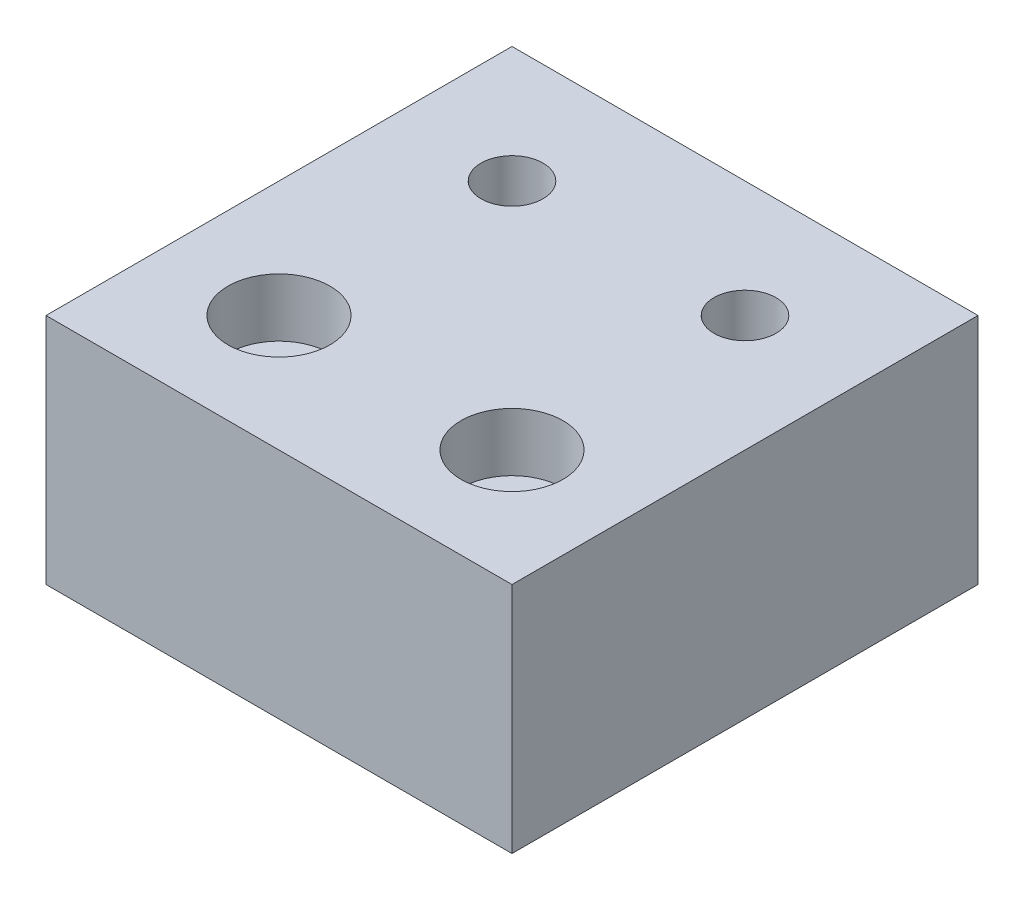
ISO-10303-21;
HEADER;
FILE_DESCRIPTION(('STEP AP214'),'2;1');
FILE_NAME('part.step','',(''),(''),'','','');
FILE_SCHEMA(('AUTOMOTIVE_DESIGN { 1 0 10303 214 1 1 1 1 }'));
ENDSEC;
DATA;
#1=APPLICATION_CONTEXT('core data for automotive mechanical design processes');
#2=APPLICATION_PROTOCOL_DEFINITION('international standard','automotive_design',2000,#1);
#3=PRODUCT_CONTEXT('',#1,'mechanical');
#4=PRODUCT('Part','Part','',(#3));
#5=PRODUCT_RELATED_PRODUCT_CATEGORY('part','',(#4));
#6=PRODUCT_DEFINITION_FORMATION('','',#4);
#7=PRODUCT_DEFINITION_CONTEXT('part definition',#1,'design');
#8=PRODUCT_DEFINITION('design','',#6,#7);
#9=PRODUCT_DEFINITION_SHAPE('','',#8);
#10=(LENGTH_UNIT() NAMED_UNIT(*) SI_UNIT(.MILLI.,.METRE.));
#11=(NAMED_UNIT(*) PLANE_ANGLE_UNIT() SI_UNIT($,.RADIAN.));
#12=(NAMED_UNIT(*) SI_UNIT($,.STERADIAN.) SOLID_ANGLE_UNIT());
#13=UNCERTAINTY_MEASURE_WITH_UNIT(LENGTH_MEASURE(1.E-05),#10,'distance_accuracy_value','');
#14=(GEOMETRIC_REPRESENTATION_CONTEXT(3) GLOBAL_UNCERTAINTY_ASSIGNED_CONTEXT((#13)) GLOBAL_UNIT_ASSIGNED_CONTEXT((#10,
#11,#12)) REPRESENTATION_CONTEXT('',''));
#15=CARTESIAN_POINT('',(0.,0.,0.));
#16=DIRECTION('',(0.,0.,1.));
#17=DIRECTION('',(1.,0.,0.));
#18=AXIS2_PLACEMENT_3D('',#15,#16,#17);
#19=CARTESIAN_POINT('',(0.,25.4,0.));
#20=DIRECTION('',(1.,0.,0.));
#21=DIRECTION('',(0.,0.,-1.));
#22=AXIS2_PLACEMENT_3D('',#19,#20,#21);
#23=PLANE('',#22);
#24=DIRECTION('',(0.,0.,1.));
#25=VECTOR('',#24,1.);
#26=CARTESIAN_POINT('',(0.,0.,0.));
#27=LINE('',#26,#25);
#28=CARTESIAN_POINT('',(0.,0.,-50.8));
#29=VERTEX_POINT('',#28);
#30=CARTESIAN_POINT('',(0.,0.,0.));
#31=VERTEX_POINT('',#30);
#32=EDGE_CURVE('E86',#29,#31,#27,.T.);
#33=ORIENTED_EDGE('',*,*,#32,.T.);
#34=DIRECTION('',(0.,-1.,0.));
#35=VECTOR('',#34,1.);
#36=CARTESIAN_POINT('',(0.,25.4,0.));
#37=LINE('',#36,#35);
#38=CARTESIAN_POINT('',(0.,25.4,0.));
#39=VERTEX_POINT('',#38);
#40=EDGE_CURVE('E11',#39,#31,#37,.T.);
#41=ORIENTED_EDGE('',*,*,#40,.F.);
#42=DIRECTION('',(0.,0.,1.));
#43=VECTOR('',#42,1.);
#44=CARTESIAN_POINT('',(0.,25.4,0.));
#45=LINE('',#44,#43);
#46=CARTESIAN_POINT('',(0.,25.4,-50.8));
#47=VERTEX_POINT('',#46);
#48=EDGE_CURVE('E80',#47,#39,#45,.T.);
#49=ORIENTED_EDGE('',*,*,#48,.F.);
#50=DIRECTION('',(0.,-1.,0.));
#51=VECTOR('',#50,1.);
#52=CARTESIAN_POINT('',(0.,25.4,-50.8));
#53=LINE('',#52,#51);
#54=EDGE_CURVE('E41',#47,#29,#53,.T.);
#55=ORIENTED_EDGE('',*,*,#54,.T.);
#56=EDGE_LOOP('',(#33,#41,#49,#55));
#57=FACE_BOUND('',#56,.T.);
#58=ADVANCED_FACE('F34',(#57),#23,.F.);
#59=CARTESIAN_POINT('',(0.,25.4,0.));
#60=DIRECTION('',(0.,0.,-1.));
#61=DIRECTION('',(-1.,0.,0.));
#62=AXIS2_PLACEMENT_3D('',#59,#60,#61);
#63=PLANE('',#62);
#64=DIRECTION('',(1.,0.,0.));
#65=VECTOR('',#64,1.);
#66=CARTESIAN_POINT('',(0.,0.,0.));
#67=LINE('',#66,#65);
#68=CARTESIAN_POINT('',(50.8,0.,0.));
#69=VERTEX_POINT('',#68);
#70=EDGE_CURVE('E81',#31,#69,#67,.T.);
#71=ORIENTED_EDGE('',*,*,#70,.T.);
#72=DIRECTION('',(0.,-1.,0.));
#73=VECTOR('',#72,1.);
#74=CARTESIAN_POINT('',(50.8,0.,0.));
#75=LINE('',#74,#73);
#76=CARTESIAN_POINT('',(50.8,25.4,0.));
#77=VERTEX_POINT('',#76);
#78=EDGE_CURVE('E48',#77,#69,#75,.T.);
#79=ORIENTED_EDGE('',*,*,#78,.F.);
#80=DIRECTION('',(1.,0.,0.));
#81=VECTOR('',#80,1.);
#82=CARTESIAN_POINT('',(0.,25.4,0.));
#83=LINE('',#82,#81);
#84=EDGE_CURVE('E98',#39,#77,#83,.T.);
#85=ORIENTED_EDGE('',*,*,#84,.F.);
#86=ORIENTED_EDGE('',*,*,#40,.T.);
#87=EDGE_LOOP('',(#71,#79,#85,#86));
#88=FACE_BOUND('',#87,.T.);
#89=ADVANCED_FACE('F143',(#88),#63,.F.);
#90=CARTESIAN_POINT('',(0.,25.4,-50.8));
#91=DIRECTION('',(0.,0.,1.));
#92=DIRECTION('',(1.,0.,0.));
#93=AXIS2_PLACEMENT_3D('',#90,#91,#92);
#94=PLANE('',#93);
#95=DIRECTION('',(-1.,0.,0.));
#96=VECTOR('',#95,1.);
#97=CARTESIAN_POINT('',(0.,25.4,-50.8));
#98=LINE('',#97,#96);
#99=CARTESIAN_POINT('',(50.8,25.4,-50.8));
#100=VERTEX_POINT('',#99);
#101=EDGE_CURVE('E57',#100,#47,#98,.T.);
#102=ORIENTED_EDGE('',*,*,#101,.F.);
#103=DIRECTION('',(0.,1.,0.));
#104=VECTOR('',#103,1.);
#105=CARTESIAN_POINT('',(50.8,0.,-50.8));
#106=LINE('',#105,#104);
#107=CARTESIAN_POINT('',(50.8,0.,-50.8));
#108=VERTEX_POINT('',#107);
#109=EDGE_CURVE('E77',#108,#100,#106,.T.);
#110=ORIENTED_EDGE('',*,*,#109,.F.);
#111=DIRECTION('',(-1.,0.,0.));
#112=VECTOR('',#111,1.);
#113=CARTESIAN_POINT('',(0.,0.,-50.8));
#114=LINE('',#113,#112);
#115=EDGE_CURVE('E71',#108,#29,#114,.T.);
#116=ORIENTED_EDGE('',*,*,#115,.T.);
#117=ORIENTED_EDGE('',*,*,#54,.F.);
#118=EDGE_LOOP('',(#102,#110,#116,#117));
#119=FACE_BOUND('',#118,.T.);
#120=ADVANCED_FACE('F73',(#119),#94,.F.);
#121=CARTESIAN_POINT('',(0.,25.4,-50.8));
#122=DIRECTION('',(0.,-1.,0.));
#123=DIRECTION('',(0.,0.,-1.));
#124=AXIS2_PLACEMENT_3D('',#121,#122,#123);
#125=PLANE('',#124);
#126=CARTESIAN_POINT('',(38.1,25.4,-38.1));
#127=DIRECTION('',(0.,1.,0.));
#128=DIRECTION('',(0.,0.,1.));
#129=AXIS2_PLACEMENT_3D('',#126,#127,#128);
#130=CIRCLE('',#129,3.3782);
#131=CARTESIAN_POINT('',(38.1,25.4,-34.7218));
#132=VERTEX_POINT('',#131);
#133=EDGE_CURVE('E128',#132,#132,#130,.T.);
#134=ORIENTED_EDGE('',*,*,#133,.F.);
#135=EDGE_LOOP('',(#134));
#136=FACE_BOUND('',#135,.T.);
#137=CARTESIAN_POINT('',(12.7,25.4,-38.1));
#138=DIRECTION('',(0.,1.,0.));
#139=DIRECTION('',(0.,0.,1.));
#140=AXIS2_PLACEMENT_3D('',#137,#138,#139);
#141=CIRCLE('',#140,3.3782);
#142=CARTESIAN_POINT('',(12.7,25.4,-34.7218));
#143=VERTEX_POINT('',#142);
#144=EDGE_CURVE('E125',#143,#143,#141,.T.);
#145=ORIENTED_EDGE('',*,*,#144,.F.);
#146=EDGE_LOOP('',(#145));
#147=FACE_BOUND('',#146,.T.);
#148=CARTESIAN_POINT('',(38.1,25.4,-12.7));
#149=DIRECTION('',(0.,1.,0.));
#150=DIRECTION('',(0.,0.,1.));
#151=AXIS2_PLACEMENT_3D('',#148,#149,#150);
#152=CIRCLE('',#151,5.55625);
#153=CARTESIAN_POINT('',(38.1,25.4,-7.14375));
#154=VERTEX_POINT('',#153);
#155=EDGE_CURVE('E119',#154,#154,#152,.T.);
#156=ORIENTED_EDGE('',*,*,#155,.F.);
#157=EDGE_LOOP('',(#156));
#158=FACE_BOUND('',#157,.T.);
#159=CARTESIAN_POINT('',(12.7,25.4,-12.7));
#160=DIRECTION('',(0.,1.,0.));
#161=DIRECTION('',(0.,0.,1.));
#162=AXIS2_PLACEMENT_3D('',#159,#160,#161);
#163=CIRCLE('',#162,5.55625);
#164=CARTESIAN_POINT('',(12.7,25.4,-7.14375));
#165=VERTEX_POINT('',#164);
#166=EDGE_CURVE('E107',#165,#165,#163,.T.);
#167=ORIENTED_EDGE('',*,*,#166,.F.);
#168=EDGE_LOOP('',(#167));
#169=FACE_BOUND('',#168,.T.);
#170=ORIENTED_EDGE('',*,*,#84,.T.);
#171=DIRECTION('',(0.,0.,1.));
#172=VECTOR('',#171,1.);
#173=CARTESIAN_POINT('',(50.8,25.4,0.));
#174=LINE('',#173,#172);
#175=EDGE_CURVE('E134',#100,#77,#174,.T.);
#176=ORIENTED_EDGE('',*,*,#175,.F.);
#177=ORIENTED_EDGE('',*,*,#101,.T.);
#178=ORIENTED_EDGE('',*,*,#48,.T.);
#179=EDGE_LOOP('',(#170,#176,#177,#178));
#180=FACE_BOUND('',#179,.T.);
#181=ADVANCED_FACE('F144',(#136,#147,#158,#169,#180),#125,.F.);
#182=CARTESIAN_POINT('',(0.,0.,-50.8));
#183=DIRECTION('',(0.,-1.,0.));
#184=DIRECTION('',(0.,0.,-1.));
#185=AXIS2_PLACEMENT_3D('',#182,#183,#184);
#186=PLANE('',#185);
#187=DIRECTION('',(0.,0.,-1.));
#188=VECTOR('',#187,1.);
#189=CARTESIAN_POINT('',(50.8,0.,0.));
#190=LINE('',#189,#188);
#191=EDGE_CURVE('E137',#69,#108,#190,.T.);
#192=ORIENTED_EDGE('',*,*,#191,.F.);
#193=ORIENTED_EDGE('',*,*,#70,.F.);
#194=ORIENTED_EDGE('',*,*,#32,.F.);
#195=ORIENTED_EDGE('',*,*,#115,.F.);
#196=EDGE_LOOP('',(#192,#193,#194,#195));
#197=FACE_BOUND('',#196,.T.);
#198=CARTESIAN_POINT('',(38.1,0.,-38.1));
#199=DIRECTION('',(0.,1.,0.));
#200=DIRECTION('',(0.,0.,1.));
#201=AXIS2_PLACEMENT_3D('',#198,#199,#200);
#202=CIRCLE('',#201,3.37819999999999);
#203=CARTESIAN_POINT('',(38.1,0.,-34.7218));
#204=VERTEX_POINT('',#203);
#205=EDGE_CURVE('E131',#204,#204,#202,.T.);
#206=ORIENTED_EDGE('',*,*,#205,.T.);
#207=EDGE_LOOP('',(#206));
#208=FACE_BOUND('',#207,.T.);
#209=CARTESIAN_POINT('',(12.7,0.,-38.1));
#210=DIRECTION('',(0.,1.,0.));
#211=DIRECTION('',(0.,0.,1.));
#212=AXIS2_PLACEMENT_3D('',#209,#210,#211);
#213=CIRCLE('',#212,3.37819999999999);
#214=CARTESIAN_POINT('',(12.7,0.,-34.7218));
#215=VERTEX_POINT('',#214);
#216=EDGE_CURVE('E122',#215,#215,#213,.T.);
#217=ORIENTED_EDGE('',*,*,#216,.T.);
#218=EDGE_LOOP('',(#217));
#219=FACE_BOUND('',#218,.T.);
#220=CARTESIAN_POINT('',(38.1,0.,-12.7));
#221=DIRECTION('',(0.,1.,0.));
#222=DIRECTION('',(0.,0.,1.));
#223=AXIS2_PLACEMENT_3D('',#220,#221,#222);
#224=CIRCLE('',#223,3.37819999999999);
#225=CARTESIAN_POINT('',(38.1,0.,-9.3218));
#226=VERTEX_POINT('',#225);
#227=EDGE_CURVE('E116',#226,#226,#224,.T.);
#228=ORIENTED_EDGE('',*,*,#227,.T.);
#229=EDGE_LOOP('',(#228));
#230=FACE_BOUND('',#229,.T.);
#231=CARTESIAN_POINT('',(12.7,0.,-12.7));
#232=DIRECTION('',(0.,1.,0.));
#233=DIRECTION('',(0.,0.,1.));
#234=AXIS2_PLACEMENT_3D('',#231,#232,#233);
#235=CIRCLE('',#234,3.37819999999999);
#236=CARTESIAN_POINT('',(12.7,0.,-9.3218));
#237=VERTEX_POINT('',#236);
#238=EDGE_CURVE('E90',#237,#237,#235,.T.);
#239=ORIENTED_EDGE('',*,*,#238,.T.);
#240=EDGE_LOOP('',(#239));
#241=FACE_BOUND('',#240,.T.);
#242=ADVANCED_FACE('F87',(#197,#208,#219,#230,#241),#186,.T.);
#243=CARTESIAN_POINT('',(12.7,25.4,-12.7));
#244=DIRECTION('',(0.,1.,0.));
#245=DIRECTION('',(0.,0.,1.));
#246=AXIS2_PLACEMENT_3D('',#243,#244,#245);
#247=CYLINDRICAL_SURFACE('',#246,3.3782);
#248=ORIENTED_EDGE('',*,*,#238,.F.);
#249=EDGE_LOOP('',(#248));
#250=FACE_BOUND('',#249,.T.);
#251=CARTESIAN_POINT('',(12.7,19.05,-12.7));
#252=DIRECTION('',(0.,1.,0.));
#253=DIRECTION('',(0.,0.,1.));
#254=AXIS2_PLACEMENT_3D('',#251,#252,#253);
#255=CIRCLE('',#254,3.3782);
#256=CARTESIAN_POINT('',(12.7,19.05,-9.3218));
#257=VERTEX_POINT('',#256);
#258=EDGE_CURVE('E94',#257,#257,#255,.T.);
#259=ORIENTED_EDGE('',*,*,#258,.T.);
#260=EDGE_LOOP('',(#259));
#261=FACE_BOUND('',#260,.T.);
#262=ADVANCED_FACE('F152',(#250,#261),#247,.F.);
#263=CARTESIAN_POINT('',(16.0782,19.05,-12.7));
#264=DIRECTION('',(0.,-1.,0.));
#265=DIRECTION('',(0.,0.,-1.));
#266=AXIS2_PLACEMENT_3D('',#263,#264,#265);
#267=PLANE('',#266);
#268=ORIENTED_EDGE('',*,*,#258,.F.);
#269=EDGE_LOOP('',(#268));
#270=FACE_BOUND('',#269,.T.);
#271=CARTESIAN_POINT('',(12.7,19.05,-12.7));
#272=DIRECTION('',(0.,1.,0.));
#273=DIRECTION('',(0.,0.,1.));
#274=AXIS2_PLACEMENT_3D('',#271,#272,#273);
#275=CIRCLE('',#274,5.55625);
#276=CARTESIAN_POINT('',(12.7,19.05,-7.14375));
#277=VERTEX_POINT('',#276);
#278=EDGE_CURVE('E104',#277,#277,#275,.T.);
#279=ORIENTED_EDGE('',*,*,#278,.T.);
#280=EDGE_LOOP('',(#279));
#281=FACE_BOUND('',#280,.T.);
#282=ADVANCED_FACE('F237',(#270,#281),#267,.F.);
#283=CARTESIAN_POINT('',(12.7,25.4,-12.7));
#284=DIRECTION('',(0.,1.,0.));
#285=DIRECTION('',(0.,0.,1.));
#286=AXIS2_PLACEMENT_3D('',#283,#284,#285);
#287=CYLINDRICAL_SURFACE('',#286,5.55625);
#288=ORIENTED_EDGE('',*,*,#278,.F.);
#289=EDGE_LOOP('',(#288));
#290=FACE_BOUND('',#289,.T.);
#291=ORIENTED_EDGE('',*,*,#166,.T.);
#292=EDGE_LOOP('',(#291));
#293=FACE_BOUND('',#292,.T.);
#294=ADVANCED_FACE('F217',(#290,#293),#287,.F.);
#295=CARTESIAN_POINT('',(38.1,25.4,-12.7));
#296=DIRECTION('',(0.,1.,0.));
#297=DIRECTION('',(0.,0.,1.));
#298=AXIS2_PLACEMENT_3D('',#295,#296,#297);
#299=CYLINDRICAL_SURFACE('',#298,3.3782);
#300=ORIENTED_EDGE('',*,*,#227,.F.);
#301=EDGE_LOOP('',(#300));
#302=FACE_BOUND('',#301,.T.);
#303=CARTESIAN_POINT('',(38.1,19.05,-12.7));
#304=DIRECTION('',(0.,1.,0.));
#305=DIRECTION('',(0.,0.,1.));
#306=AXIS2_PLACEMENT_3D('',#303,#304,#305);
#307=CIRCLE('',#306,3.3782);
#308=CARTESIAN_POINT('',(38.1,19.05,-9.3218));
#309=VERTEX_POINT('',#308);
#310=EDGE_CURVE('E110',#309,#309,#307,.T.);
#311=ORIENTED_EDGE('',*,*,#310,.T.);
#312=EDGE_LOOP('',(#311));
#313=FACE_BOUND('',#312,.T.);
#314=ADVANCED_FACE('F208',(#302,#313),#299,.F.);
#315=CARTESIAN_POINT('',(41.4782,19.05,-12.7));
#316=DIRECTION('',(0.,-1.,0.));
#317=DIRECTION('',(0.,0.,-1.));
#318=AXIS2_PLACEMENT_3D('',#315,#316,#317);
#319=PLANE('',#318);
#320=ORIENTED_EDGE('',*,*,#310,.F.);
#321=EDGE_LOOP('',(#320));
#322=FACE_BOUND('',#321,.T.);
#323=CARTESIAN_POINT('',(38.1,19.05,-12.7));
#324=DIRECTION('',(0.,1.,0.));
#325=DIRECTION('',(0.,0.,1.));
#326=AXIS2_PLACEMENT_3D('',#323,#324,#325);
#327=CIRCLE('',#326,5.55625);
#328=CARTESIAN_POINT('',(38.1,19.05,-7.14375));
#329=VERTEX_POINT('',#328);
#330=EDGE_CURVE('E113',#329,#329,#327,.T.);
#331=ORIENTED_EDGE('',*,*,#330,.T.);
#332=EDGE_LOOP('',(#331));
#333=FACE_BOUND('',#332,.T.);
#334=ADVANCED_FACE('F214',(#322,#333),#319,.F.);
#335=CARTESIAN_POINT('',(38.1,25.4,-12.7));
#336=DIRECTION('',(0.,1.,0.));
#337=DIRECTION('',(0.,0.,1.));
#338=AXIS2_PLACEMENT_3D('',#335,#336,#337);
#339=CYLINDRICAL_SURFACE('',#338,5.55625);
#340=ORIENTED_EDGE('',*,*,#330,.F.);
#341=EDGE_LOOP('',(#340));
#342=FACE_BOUND('',#341,.T.);
#343=ORIENTED_EDGE('',*,*,#155,.T.);
#344=EDGE_LOOP('',(#343));
#345=FACE_BOUND('',#344,.T.);
#346=ADVANCED_FACE('F205',(#342,#345),#339,.F.);
#347=CARTESIAN_POINT('',(12.7,25.4,-38.1));
#348=DIRECTION('',(0.,1.,0.));
#349=DIRECTION('',(0.,0.,1.));
#350=AXIS2_PLACEMENT_3D('',#347,#348,#349);
#351=CYLINDRICAL_SURFACE('',#350,3.3782);
#352=ORIENTED_EDGE('',*,*,#216,.F.);
#353=EDGE_LOOP('',(#352));
#354=FACE_BOUND('',#353,.T.);
#355=ORIENTED_EDGE('',*,*,#144,.T.);
#356=EDGE_LOOP('',(#355));
#357=FACE_BOUND('',#356,.T.);
#358=ADVANCED_FACE('F198',(#354,#357),#351,.F.);
#359=CARTESIAN_POINT('',(38.1,25.4,-38.1));
#360=DIRECTION('',(0.,1.,0.));
#361=DIRECTION('',(0.,0.,1.));
#362=AXIS2_PLACEMENT_3D('',#359,#360,#361);
#363=CYLINDRICAL_SURFACE('',#362,3.3782);
#364=ORIENTED_EDGE('',*,*,#205,.F.);
#365=EDGE_LOOP('',(#364));
#366=FACE_BOUND('',#365,.T.);
#367=ORIENTED_EDGE('',*,*,#133,.T.);
#368=EDGE_LOOP('',(#367));
#369=FACE_BOUND('',#368,.T.);
#370=ADVANCED_FACE('F189',(#366,#369),#363,.F.);
#371=CARTESIAN_POINT('',(50.8,25.4,0.));
#372=DIRECTION('',(-1.,0.,0.));
#373=DIRECTION('',(0.,0.,1.));
#374=AXIS2_PLACEMENT_3D('',#371,#372,#373);
#375=PLANE('',#374);
#376=ORIENTED_EDGE('',*,*,#78,.T.);
#377=ORIENTED_EDGE('',*,*,#191,.T.);
#378=ORIENTED_EDGE('',*,*,#109,.T.);
#379=ORIENTED_EDGE('',*,*,#175,.T.);
#380=EDGE_LOOP('',(#376,#377,#378,#379));
#381=FACE_BOUND('',#380,.T.);
#382=ADVANCED_FACE('F139',(#381),#375,.F.);
#383=CLOSED_SHELL('',(#58,#89,#120,#181,#242,#262,#282,#294,#314,#334,#346,#358,#370,#382));
#384=MANIFOLD_SOLID_BREP('B2',#383);
#385=ADVANCED_BREP_SHAPE_REPRESENTATION('',(#18,#384),#14);
#386=SHAPE_DEFINITION_REPRESENTATION(#9,#385);
ENDSEC;
END-ISO-10303-21;
